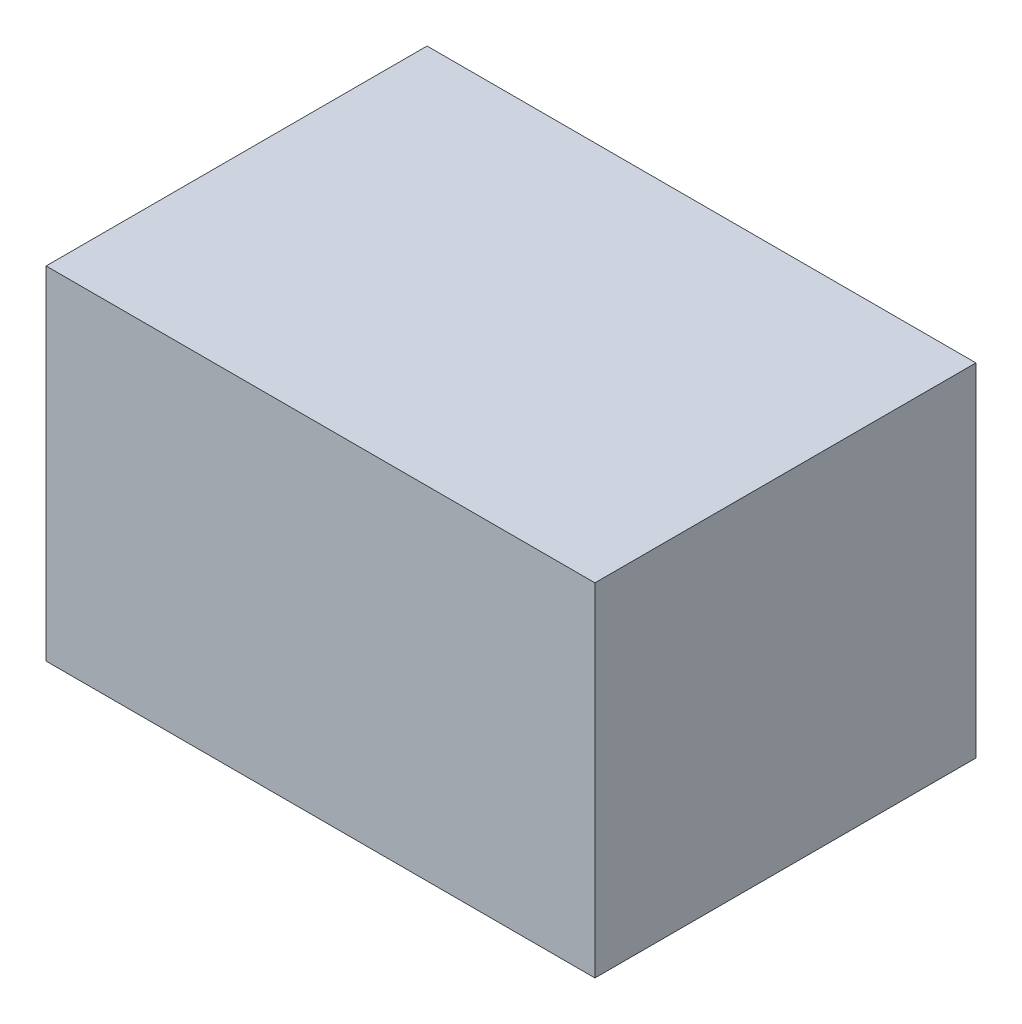
ISO-10303-21;
HEADER;
FILE_DESCRIPTION(('STEP AP214'),'2;1');
FILE_NAME('part.step','',(''),(''),'','','');
FILE_SCHEMA(('AUTOMOTIVE_DESIGN { 1 0 10303 214 1 1 1 1 }'));
ENDSEC;
DATA;
#1=APPLICATION_CONTEXT('core data for automotive mechanical design processes');
#2=APPLICATION_PROTOCOL_DEFINITION('international standard','automotive_design',2000,#1);
#3=PRODUCT_CONTEXT('',#1,'mechanical');
#4=PRODUCT('Part','Part','',(#3));
#5=PRODUCT_RELATED_PRODUCT_CATEGORY('part','',(#4));
#6=PRODUCT_DEFINITION_FORMATION('','',#4);
#7=PRODUCT_DEFINITION_CONTEXT('part definition',#1,'design');
#8=PRODUCT_DEFINITION('design','',#6,#7);
#9=PRODUCT_DEFINITION_SHAPE('','',#8);
#10=(LENGTH_UNIT() NAMED_UNIT(*) SI_UNIT(.MILLI.,.METRE.));
#11=(NAMED_UNIT(*) PLANE_ANGLE_UNIT() SI_UNIT($,.RADIAN.));
#12=(NAMED_UNIT(*) SI_UNIT($,.STERADIAN.) SOLID_ANGLE_UNIT());
#13=UNCERTAINTY_MEASURE_WITH_UNIT(LENGTH_MEASURE(1.E-05),#10,'distance_accuracy_value','');
#14=(GEOMETRIC_REPRESENTATION_CONTEXT(3) GLOBAL_UNCERTAINTY_ASSIGNED_CONTEXT((#13)) GLOBAL_UNIT_ASSIGNED_CONTEXT((#10,
#11,#12)) REPRESENTATION_CONTEXT('',''));
#15=CARTESIAN_POINT('',(0.,0.,0.));
#16=DIRECTION('',(0.,0.,1.));
#17=DIRECTION('',(1.,0.,0.));
#18=AXIS2_PLACEMENT_3D('',#15,#16,#17);
#19=CARTESIAN_POINT('',(2.12499956,1.32500116,0.));
#20=DIRECTION('',(0.,-1.,0.));
#21=DIRECTION('',(0.,0.,-1.));
#22=AXIS2_PLACEMENT_3D('',#19,#20,#21);
#23=PLANE('',#22);
#24=DIRECTION('',(0.,0.,-1.));
#25=VECTOR('',#24,1.);
#26=CARTESIAN_POINT('',(-2.12499956,1.32500116,0.));
#27=LINE('',#26,#25);
#28=CARTESIAN_POINT('',(-2.12499956,1.32500116,0.));
#29=VERTEX_POINT('',#28);
#30=CARTESIAN_POINT('',(-2.12499956,1.32500116,2.94999918));
#31=VERTEX_POINT('',#30);
#32=EDGE_CURVE('E19',#29,#31,#27,.F.);
#33=ORIENTED_EDGE('',*,*,#32,.T.);
#34=DIRECTION('',(-1.,0.,0.));
#35=VECTOR('',#34,1.);
#36=CARTESIAN_POINT('',(-2.12499956,1.32500116,2.94999918));
#37=LINE('',#36,#35);
#38=CARTESIAN_POINT('',(2.12499956,1.32500116,2.94999918));
#39=VERTEX_POINT('',#38);
#40=EDGE_CURVE('E54',#31,#39,#37,.F.);
#41=ORIENTED_EDGE('',*,*,#40,.T.);
#42=DIRECTION('',(0.,0.,1.));
#43=VECTOR('',#42,1.);
#44=CARTESIAN_POINT('',(2.12499956,1.32500116,0.));
#45=LINE('',#44,#43);
#46=CARTESIAN_POINT('',(2.12499956,1.32500116,0.));
#47=VERTEX_POINT('',#46);
#48=EDGE_CURVE('E73',#39,#47,#45,.F.);
#49=ORIENTED_EDGE('',*,*,#48,.T.);
#50=DIRECTION('',(-1.,0.,0.));
#51=VECTOR('',#50,1.);
#52=CARTESIAN_POINT('',(-2.12499956,1.32500116,0.));
#53=LINE('',#52,#51);
#54=EDGE_CURVE('E65',#29,#47,#53,.F.);
#55=ORIENTED_EDGE('',*,*,#54,.F.);
#56=EDGE_LOOP('',(#33,#41,#49,#55));
#57=FACE_BOUND('',#56,.T.);
#58=ADVANCED_FACE('F16',(#57),#23,.F.);
#59=CARTESIAN_POINT('',(-2.12499956,1.32500116,0.));
#60=DIRECTION('',(1.,0.,0.));
#61=DIRECTION('',(0.,0.,-1.));
#62=AXIS2_PLACEMENT_3D('',#59,#60,#61);
#63=PLANE('',#62);
#64=DIRECTION('',(0.,0.,1.));
#65=VECTOR('',#64,1.);
#66=CARTESIAN_POINT('',(-2.12499956,-1.32500116,0.));
#67=LINE('',#66,#65);
#68=CARTESIAN_POINT('',(-2.12499956,-1.32500116,0.));
#69=VERTEX_POINT('',#68);
#70=CARTESIAN_POINT('',(-2.12499956,-1.32500116,2.94999918));
#71=VERTEX_POINT('',#70);
#72=EDGE_CURVE('E71',#69,#71,#67,.T.);
#73=ORIENTED_EDGE('',*,*,#72,.T.);
#74=DIRECTION('',(0.,1.,0.));
#75=VECTOR('',#74,1.);
#76=CARTESIAN_POINT('',(-2.12499956,1.32500116,2.94999918));
#77=LINE('',#76,#75);
#78=EDGE_CURVE('E61',#71,#31,#77,.T.);
#79=ORIENTED_EDGE('',*,*,#78,.T.);
#80=ORIENTED_EDGE('',*,*,#32,.F.);
#81=DIRECTION('',(0.,1.,0.));
#82=VECTOR('',#81,1.);
#83=CARTESIAN_POINT('',(-2.12499956,1.32500116,0.));
#84=LINE('',#83,#82);
#85=EDGE_CURVE('E79',#69,#29,#84,.T.);
#86=ORIENTED_EDGE('',*,*,#85,.F.);
#87=EDGE_LOOP('',(#73,#79,#80,#86));
#88=FACE_BOUND('',#87,.T.);
#89=ADVANCED_FACE('F70',(#88),#63,.F.);
#90=CARTESIAN_POINT('',(-2.12499956,1.32500116,2.94999918));
#91=DIRECTION('',(0.,0.,-1.));
#92=DIRECTION('',(-1.,0.,0.));
#93=AXIS2_PLACEMENT_3D('',#90,#91,#92);
#94=PLANE('',#93);
#95=DIRECTION('',(1.,0.,0.));
#96=VECTOR('',#95,1.);
#97=CARTESIAN_POINT('',(-2.12499956,-1.32500116,2.94999918));
#98=LINE('',#97,#96);
#99=CARTESIAN_POINT('',(2.12499956,-1.32500116,2.94999918));
#100=VERTEX_POINT('',#99);
#101=EDGE_CURVE('E82',#71,#100,#98,.T.);
#102=ORIENTED_EDGE('',*,*,#101,.T.);
#103=DIRECTION('',(0.,1.,0.));
#104=VECTOR('',#103,1.);
#105=CARTESIAN_POINT('',(2.12499956,-1.32500116,2.94999918));
#106=LINE('',#105,#104);
#107=EDGE_CURVE('E63',#100,#39,#106,.T.);
#108=ORIENTED_EDGE('',*,*,#107,.T.);
#109=ORIENTED_EDGE('',*,*,#40,.F.);
#110=ORIENTED_EDGE('',*,*,#78,.F.);
#111=EDGE_LOOP('',(#102,#108,#109,#110));
#112=FACE_BOUND('',#111,.T.);
#113=ADVANCED_FACE('F59',(#112),#94,.F.);
#114=CARTESIAN_POINT('',(2.12499956,-1.32500116,0.));
#115=DIRECTION('',(-1.,0.,0.));
#116=DIRECTION('',(0.,0.,1.));
#117=AXIS2_PLACEMENT_3D('',#114,#115,#116);
#118=PLANE('',#117);
#119=ORIENTED_EDGE('',*,*,#48,.F.);
#120=ORIENTED_EDGE('',*,*,#107,.F.);
#121=DIRECTION('',(0.,0.,1.));
#122=VECTOR('',#121,1.);
#123=CARTESIAN_POINT('',(2.12499956,-1.32500116,0.));
#124=LINE('',#123,#122);
#125=CARTESIAN_POINT('',(2.12499956,-1.32500116,0.));
#126=VERTEX_POINT('',#125);
#127=EDGE_CURVE('E25',#100,#126,#124,.F.);
#128=ORIENTED_EDGE('',*,*,#127,.T.);
#129=DIRECTION('',(0.,1.,0.));
#130=VECTOR('',#129,1.);
#131=CARTESIAN_POINT('',(2.12499956,1.32500116,0.));
#132=LINE('',#131,#130);
#133=EDGE_CURVE('E33',#47,#126,#132,.F.);
#134=ORIENTED_EDGE('',*,*,#133,.F.);
#135=EDGE_LOOP('',(#119,#120,#128,#134));
#136=FACE_BOUND('',#135,.T.);
#137=ADVANCED_FACE('F87',(#136),#118,.F.);
#138=CARTESIAN_POINT('',(-2.12499956,1.32500116,0.));
#139=DIRECTION('',(0.,0.,-1.));
#140=DIRECTION('',(-1.,0.,0.));
#141=AXIS2_PLACEMENT_3D('',#138,#139,#140);
#142=PLANE('',#141);
#143=DIRECTION('',(1.,0.,0.));
#144=VECTOR('',#143,1.);
#145=CARTESIAN_POINT('',(-2.12499956,-1.32500116,0.));
#146=LINE('',#145,#144);
#147=EDGE_CURVE('E11',#126,#69,#146,.F.);
#148=ORIENTED_EDGE('',*,*,#147,.T.);
#149=ORIENTED_EDGE('',*,*,#85,.T.);
#150=ORIENTED_EDGE('',*,*,#54,.T.);
#151=ORIENTED_EDGE('',*,*,#133,.T.);
#152=EDGE_LOOP('',(#148,#149,#150,#151));
#153=FACE_BOUND('',#152,.T.);
#154=ADVANCED_FACE('F90',(#153),#142,.T.);
#155=CARTESIAN_POINT('',(-2.12499956,-1.32500116,0.));
#156=DIRECTION('',(0.,1.,0.));
#157=DIRECTION('',(0.,0.,1.));
#158=AXIS2_PLACEMENT_3D('',#155,#156,#157);
#159=PLANE('',#158);
#160=ORIENTED_EDGE('',*,*,#127,.F.);
#161=ORIENTED_EDGE('',*,*,#101,.F.);
#162=ORIENTED_EDGE('',*,*,#72,.F.);
#163=ORIENTED_EDGE('',*,*,#147,.F.);
#164=EDGE_LOOP('',(#160,#161,#162,#163));
#165=FACE_BOUND('',#164,.T.);
#166=ADVANCED_FACE('F89',(#165),#159,.F.);
#167=CLOSED_SHELL('',(#58,#89,#113,#137,#154,#166));
#168=MANIFOLD_SOLID_BREP('B1',#167);
#169=ADVANCED_BREP_SHAPE_REPRESENTATION('',(#18,#168),#14);
#170=SHAPE_DEFINITION_REPRESENTATION(#9,#169);
ENDSEC;
END-ISO-10303-21;
